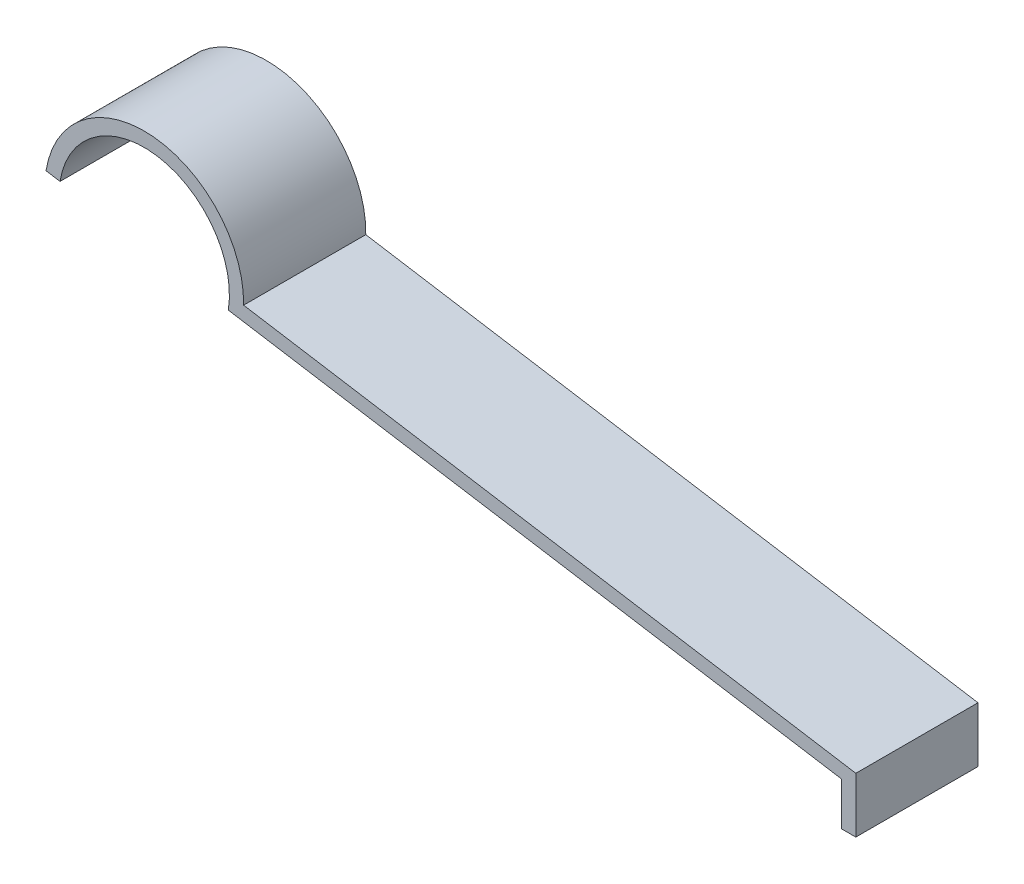
ISO-10303-21;
HEADER;
FILE_DESCRIPTION(('STEP AP214'),'2;1');
FILE_NAME('part.step','',(''),(''),'','','');
FILE_SCHEMA(('AUTOMOTIVE_DESIGN { 1 0 10303 214 1 1 1 1 }'));
ENDSEC;
DATA;
#1=APPLICATION_CONTEXT('core data for automotive mechanical design processes');
#2=APPLICATION_PROTOCOL_DEFINITION('international standard','automotive_design',2000,#1);
#3=PRODUCT_CONTEXT('',#1,'mechanical');
#4=PRODUCT('Part','Part','',(#3));
#5=PRODUCT_RELATED_PRODUCT_CATEGORY('part','',(#4));
#6=PRODUCT_DEFINITION_FORMATION('','',#4);
#7=PRODUCT_DEFINITION_CONTEXT('part definition',#1,'design');
#8=PRODUCT_DEFINITION('design','',#6,#7);
#9=PRODUCT_DEFINITION_SHAPE('','',#8);
#10=(LENGTH_UNIT() NAMED_UNIT(*) SI_UNIT(.MILLI.,.METRE.));
#11=(NAMED_UNIT(*) PLANE_ANGLE_UNIT() SI_UNIT($,.RADIAN.));
#12=(NAMED_UNIT(*) SI_UNIT($,.STERADIAN.) SOLID_ANGLE_UNIT());
#13=UNCERTAINTY_MEASURE_WITH_UNIT(LENGTH_MEASURE(1.E-05),#10,'distance_accuracy_value','');
#14=(GEOMETRIC_REPRESENTATION_CONTEXT(3) GLOBAL_UNCERTAINTY_ASSIGNED_CONTEXT((#13)) GLOBAL_UNIT_ASSIGNED_CONTEXT((#10,
#11,#12)) REPRESENTATION_CONTEXT('',''));
#15=CARTESIAN_POINT('',(0.,0.,0.));
#16=DIRECTION('',(0.,0.,1.));
#17=DIRECTION('',(1.,0.,0.));
#18=AXIS2_PLACEMENT_3D('',#15,#16,#17);
#19=CARTESIAN_POINT('',(0.5,0.,2.15));
#20=DIRECTION('',(0.,1.,0.));
#21=DIRECTION('',(-1.,0.,0.));
#22=AXIS2_PLACEMENT_3D('',#19,#20,#21);
#23=PLANE('',#22);
#24=DIRECTION('',(1.,0.,0.));
#25=VECTOR('',#24,1.);
#26=CARTESIAN_POINT('',(0.5,0.,-2.15));
#27=LINE('',#26,#25);
#28=CARTESIAN_POINT('',(0.,0.,-2.15));
#29=VERTEX_POINT('',#28);
#30=CARTESIAN_POINT('',(0.5,0.,-2.15));
#31=VERTEX_POINT('',#30);
#32=EDGE_CURVE('E85',#29,#31,#27,.T.);
#33=ORIENTED_EDGE('',*,*,#32,.T.);
#34=DIRECTION('',(0.,0.,-1.));
#35=VECTOR('',#34,1.);
#36=CARTESIAN_POINT('',(0.5,0.,2.15));
#37=LINE('',#36,#35);
#38=CARTESIAN_POINT('',(0.5,0.,2.15));
#39=VERTEX_POINT('',#38);
#40=EDGE_CURVE('E11',#39,#31,#37,.T.);
#41=ORIENTED_EDGE('',*,*,#40,.F.);
#42=DIRECTION('',(1.,0.,0.));
#43=VECTOR('',#42,1.);
#44=CARTESIAN_POINT('',(0.5,0.,2.15));
#45=LINE('',#44,#43);
#46=CARTESIAN_POINT('',(0.,0.,2.15));
#47=VERTEX_POINT('',#46);
#48=EDGE_CURVE('E112',#47,#39,#45,.T.);
#49=ORIENTED_EDGE('',*,*,#48,.F.);
#50=DIRECTION('',(0.,0.,-1.));
#51=VECTOR('',#50,1.);
#52=CARTESIAN_POINT('',(0.,0.,2.15));
#53=LINE('',#52,#51);
#54=EDGE_CURVE('E98',#47,#29,#53,.T.);
#55=ORIENTED_EDGE('',*,*,#54,.T.);
#56=EDGE_LOOP('',(#33,#41,#49,#55));
#57=FACE_BOUND('',#56,.T.);
#58=ADVANCED_FACE('F17',(#57),#23,.F.);
#59=CARTESIAN_POINT('',(0.5,1.9454581226,2.15));
#60=DIRECTION('',(-1.,0.,0.));
#61=DIRECTION('',(0.,-1.,0.));
#62=AXIS2_PLACEMENT_3D('',#59,#60,#61);
#63=PLANE('',#62);
#64=DIRECTION('',(0.,1.,0.));
#65=VECTOR('',#64,1.);
#66=CARTESIAN_POINT('',(0.5,1.9454581226,-2.15));
#67=LINE('',#66,#65);
#68=CARTESIAN_POINT('',(0.5,1.9454581226,-2.15));
#69=VERTEX_POINT('',#68);
#70=EDGE_CURVE('E81',#31,#69,#67,.T.);
#71=ORIENTED_EDGE('',*,*,#70,.T.);
#72=DIRECTION('',(0.,0.,-1.));
#73=VECTOR('',#72,1.);
#74=CARTESIAN_POINT('',(0.5,1.9454581226,2.15));
#75=LINE('',#74,#73);
#76=CARTESIAN_POINT('',(0.5,1.9454581226,2.15));
#77=VERTEX_POINT('',#76);
#78=EDGE_CURVE('E24',#77,#69,#75,.T.);
#79=ORIENTED_EDGE('',*,*,#78,.F.);
#80=DIRECTION('',(0.,1.,0.));
#81=VECTOR('',#80,1.);
#82=CARTESIAN_POINT('',(0.5,1.9454581226,2.15));
#83=LINE('',#82,#81);
#84=EDGE_CURVE('E94',#39,#77,#83,.T.);
#85=ORIENTED_EDGE('',*,*,#84,.F.);
#86=ORIENTED_EDGE('',*,*,#40,.T.);
#87=EDGE_LOOP('',(#71,#79,#85,#86));
#88=FACE_BOUND('',#87,.T.);
#89=ADVANCED_FACE('F93',(#88),#63,.F.);
#90=CARTESIAN_POINT('',(-21.0456504402222,5.43895121023184,2.15));
#91=DIRECTION('',(-0.160053473035748,-0.987108345506812,0.));
#92=DIRECTION('',(0.987108345506812,-0.160053473035748,0.));
#93=AXIS2_PLACEMENT_3D('',#90,#91,#92);
#94=PLANE('',#93);
#95=DIRECTION('',(-0.987108345506812,0.160053473035748,0.));
#96=VECTOR('',#95,1.);
#97=CARTESIAN_POINT('',(-21.0456504402222,5.43895121023184,-2.15));
#98=LINE('',#97,#96);
#99=CARTESIAN_POINT('',(-21.0456504402222,5.43895121023184,-2.15));
#100=VERTEX_POINT('',#99);
#101=EDGE_CURVE('E87',#69,#100,#98,.T.);
#102=ORIENTED_EDGE('',*,*,#101,.T.);
#103=DIRECTION('',(0.,0.,-1.));
#104=VECTOR('',#103,1.);
#105=CARTESIAN_POINT('',(-21.0456504402222,5.43895121023184,2.15));
#106=LINE('',#105,#104);
#107=CARTESIAN_POINT('',(-21.0456504402222,5.43895121023184,2.15));
#108=VERTEX_POINT('',#107);
#109=EDGE_CURVE('E138',#108,#100,#106,.T.);
#110=ORIENTED_EDGE('',*,*,#109,.F.);
#111=DIRECTION('',(-0.987108345506812,0.160053473035748,0.));
#112=VECTOR('',#111,1.);
#113=CARTESIAN_POINT('',(-21.0456504402222,5.43895121023184,2.15));
#114=LINE('',#113,#112);
#115=EDGE_CURVE('E115',#77,#108,#114,.T.);
#116=ORIENTED_EDGE('',*,*,#115,.F.);
#117=ORIENTED_EDGE('',*,*,#78,.T.);
#118=EDGE_LOOP('',(#102,#110,#116,#117));
#119=FACE_BOUND('',#118,.T.);
#120=ADVANCED_FACE('F142',(#119),#94,.F.);
#121=CARTESIAN_POINT('',(-24.5451207907261,5.49983853192998,2.15));
#122=DIRECTION('',(0.,0.,-1.));
#123=DIRECTION('',(-1.,0.,0.));
#124=AXIS2_PLACEMENT_3D('',#121,#122,#123);
#125=CYLINDRICAL_SURFACE('',#124,3.5);
#126=CARTESIAN_POINT('',(-24.5451207907261,5.49983853192998,-2.15));
#127=DIRECTION('',(0.,0.,1.));
#128=DIRECTION('',(-1.,0.,0.));
#129=AXIS2_PLACEMENT_3D('',#126,#127,#128);
#130=CIRCLE('',#129,3.5);
#131=CARTESIAN_POINT('',(-28.,6.0600256875551,-2.15));
#132=VERTEX_POINT('',#131);
#133=EDGE_CURVE('E102',#100,#132,#130,.T.);
#134=ORIENTED_EDGE('',*,*,#133,.T.);
#135=DIRECTION('',(0.,0.,-1.));
#136=VECTOR('',#135,1.);
#137=CARTESIAN_POINT('',(-28.,6.0600256875551,2.15));
#138=LINE('',#137,#136);
#139=CARTESIAN_POINT('',(-28.,6.0600256875551,2.15));
#140=VERTEX_POINT('',#139);
#141=EDGE_CURVE('E135',#140,#132,#138,.T.);
#142=ORIENTED_EDGE('',*,*,#141,.F.);
#143=CARTESIAN_POINT('',(-24.5451207907261,5.49983853192998,2.15));
#144=DIRECTION('',(0.,0.,1.));
#145=DIRECTION('',(-1.,0.,0.));
#146=AXIS2_PLACEMENT_3D('',#143,#144,#145);
#147=CIRCLE('',#146,3.5);
#148=EDGE_CURVE('E117',#108,#140,#147,.T.);
#149=ORIENTED_EDGE('',*,*,#148,.F.);
#150=ORIENTED_EDGE('',*,*,#109,.T.);
#151=EDGE_LOOP('',(#134,#142,#149,#150));
#152=FACE_BOUND('',#151,.T.);
#153=ADVANCED_FACE('F150',(#152),#125,.T.);
#154=CARTESIAN_POINT('',(-27.5064458272466,5.97999895103722,2.15));
#155=DIRECTION('',(0.16005347303575,0.987108345506811,0.));
#156=DIRECTION('',(-0.987108345506811,0.16005347303575,0.));
#157=AXIS2_PLACEMENT_3D('',#154,#155,#156);
#158=PLANE('',#157);
#159=DIRECTION('',(0.987108345506811,-0.16005347303575,0.));
#160=VECTOR('',#159,1.);
#161=CARTESIAN_POINT('',(-27.5064458272466,5.97999895103722,-2.15));
#162=LINE('',#161,#160);
#163=CARTESIAN_POINT('',(-27.5064458272466,5.97999895103722,-2.15));
#164=VERTEX_POINT('',#163);
#165=EDGE_CURVE('E104',#132,#164,#162,.T.);
#166=ORIENTED_EDGE('',*,*,#165,.T.);
#167=DIRECTION('',(0.,0.,-1.));
#168=VECTOR('',#167,1.);
#169=CARTESIAN_POINT('',(-27.5064458272466,5.97999895103722,2.15));
#170=LINE('',#169,#168);
#171=CARTESIAN_POINT('',(-27.5064458272466,5.97999895103722,2.15));
#172=VERTEX_POINT('',#171);
#173=EDGE_CURVE('E132',#172,#164,#170,.T.);
#174=ORIENTED_EDGE('',*,*,#173,.F.);
#175=DIRECTION('',(0.987108345506811,-0.16005347303575,0.));
#176=VECTOR('',#175,1.);
#177=CARTESIAN_POINT('',(-27.5064458272466,5.97999895103722,2.15));
#178=LINE('',#177,#176);
#179=EDGE_CURVE('E119',#140,#172,#178,.T.);
#180=ORIENTED_EDGE('',*,*,#179,.F.);
#181=ORIENTED_EDGE('',*,*,#141,.T.);
#182=EDGE_LOOP('',(#166,#174,#180,#181));
#183=FACE_BOUND('',#182,.T.);
#184=ADVANCED_FACE('F153',(#183),#158,.F.);
#185=CARTESIAN_POINT('',(-24.5451207907261,5.49983853192998,2.15));
#186=DIRECTION('',(0.,0.,-1.));
#187=DIRECTION('',(-1.,0.,0.));
#188=AXIS2_PLACEMENT_3D('',#185,#186,#187);
#189=CYLINDRICAL_SURFACE('',#188,3.);
#190=CARTESIAN_POINT('',(-24.5451207907261,5.49983853192998,-2.15));
#191=DIRECTION('',(0.,0.,-1.));
#192=DIRECTION('',(-1.,0.,0.));
#193=AXIS2_PLACEMENT_3D('',#190,#191,#192);
#194=CIRCLE('',#193,3.);
#195=CARTESIAN_POINT('',(-21.5837957542057,5.01967811282274,-2.15));
#196=VERTEX_POINT('',#195);
#197=EDGE_CURVE('E106',#164,#196,#194,.T.);
#198=ORIENTED_EDGE('',*,*,#197,.T.);
#199=DIRECTION('',(0.,0.,-1.));
#200=VECTOR('',#199,1.);
#201=CARTESIAN_POINT('',(-21.5837957542057,5.01967811282274,2.15));
#202=LINE('',#201,#200);
#203=CARTESIAN_POINT('',(-21.5837957542057,5.01967811282274,2.15));
#204=VERTEX_POINT('',#203);
#205=EDGE_CURVE('E129',#204,#196,#202,.T.);
#206=ORIENTED_EDGE('',*,*,#205,.F.);
#207=CARTESIAN_POINT('',(-24.5451207907261,5.49983853192998,2.15));
#208=DIRECTION('',(0.,0.,-1.));
#209=DIRECTION('',(-1.,0.,0.));
#210=AXIS2_PLACEMENT_3D('',#207,#208,#209);
#211=CIRCLE('',#210,3.);
#212=EDGE_CURVE('E121',#172,#204,#211,.T.);
#213=ORIENTED_EDGE('',*,*,#212,.F.);
#214=ORIENTED_EDGE('',*,*,#173,.T.);
#215=EDGE_LOOP('',(#198,#206,#213,#214));
#216=FACE_BOUND('',#215,.T.);
#217=ADVANCED_FACE('F158',(#216),#189,.F.);
#218=CARTESIAN_POINT('',(-21.5837957542057,5.01967811282274,2.15));
#219=DIRECTION('',(0.160053473035748,0.987108345506812,0.));
#220=DIRECTION('',(-0.987108345506812,0.160053473035748,0.));
#221=AXIS2_PLACEMENT_3D('',#218,#219,#220);
#222=PLANE('',#221);
#223=DIRECTION('',(0.987108345506812,-0.160053473035748,0.));
#224=VECTOR('',#223,1.);
#225=CARTESIAN_POINT('',(-21.5837957542057,5.01967811282274,-2.15));
#226=LINE('',#225,#224);
#227=CARTESIAN_POINT('',(0.,1.52,-2.15));
#228=VERTEX_POINT('',#227);
#229=EDGE_CURVE('E108',#196,#228,#226,.T.);
#230=ORIENTED_EDGE('',*,*,#229,.T.);
#231=DIRECTION('',(0.,0.,-1.));
#232=VECTOR('',#231,1.);
#233=CARTESIAN_POINT('',(0.,1.52,2.15));
#234=LINE('',#233,#232);
#235=CARTESIAN_POINT('',(0.,1.52,2.15));
#236=VERTEX_POINT('',#235);
#237=EDGE_CURVE('E126',#236,#228,#234,.T.);
#238=ORIENTED_EDGE('',*,*,#237,.F.);
#239=DIRECTION('',(0.987108345506812,-0.160053473035748,0.));
#240=VECTOR('',#239,1.);
#241=CARTESIAN_POINT('',(-21.5837957542057,5.01967811282274,2.15));
#242=LINE('',#241,#240);
#243=EDGE_CURVE('E36',#204,#236,#242,.T.);
#244=ORIENTED_EDGE('',*,*,#243,.F.);
#245=ORIENTED_EDGE('',*,*,#205,.T.);
#246=EDGE_LOOP('',(#230,#238,#244,#245));
#247=FACE_BOUND('',#246,.T.);
#248=ADVANCED_FACE('F161',(#247),#222,.F.);
#249=CARTESIAN_POINT('',(0.,0.,2.15));
#250=DIRECTION('',(1.,0.,0.));
#251=DIRECTION('',(0.,0.,-1.));
#252=AXIS2_PLACEMENT_3D('',#249,#250,#251);
#253=PLANE('',#252);
#254=DIRECTION('',(0.,-1.,0.));
#255=VECTOR('',#254,1.);
#256=CARTESIAN_POINT('',(0.,0.,-2.15));
#257=LINE('',#256,#255);
#258=EDGE_CURVE('E110',#228,#29,#257,.T.);
#259=ORIENTED_EDGE('',*,*,#258,.T.);
#260=ORIENTED_EDGE('',*,*,#54,.F.);
#261=DIRECTION('',(0.,-1.,0.));
#262=VECTOR('',#261,1.);
#263=CARTESIAN_POINT('',(0.,0.,2.15));
#264=LINE('',#263,#262);
#265=EDGE_CURVE('E31',#236,#47,#264,.T.);
#266=ORIENTED_EDGE('',*,*,#265,.F.);
#267=ORIENTED_EDGE('',*,*,#237,.T.);
#268=EDGE_LOOP('',(#259,#260,#266,#267));
#269=FACE_BOUND('',#268,.T.);
#270=ADVANCED_FACE('F163',(#269),#253,.F.);
#271=CARTESIAN_POINT('',(-24.5451207907261,5.49983853192998,2.15));
#272=DIRECTION('',(0.,0.,-1.));
#273=DIRECTION('',(-1.,0.,0.));
#274=AXIS2_PLACEMENT_3D('',#271,#272,#273);
#275=PLANE('',#274);
#276=ORIENTED_EDGE('',*,*,#48,.T.);
#277=ORIENTED_EDGE('',*,*,#84,.T.);
#278=ORIENTED_EDGE('',*,*,#115,.T.);
#279=ORIENTED_EDGE('',*,*,#148,.T.);
#280=ORIENTED_EDGE('',*,*,#179,.T.);
#281=ORIENTED_EDGE('',*,*,#212,.T.);
#282=ORIENTED_EDGE('',*,*,#243,.T.);
#283=ORIENTED_EDGE('',*,*,#265,.T.);
#284=EDGE_LOOP('',(#276,#277,#278,#279,#280,#281,#282,#283));
#285=FACE_BOUND('',#284,.T.);
#286=ADVANCED_FACE('F145',(#285),#275,.F.);
#287=CARTESIAN_POINT('',(-24.5451207907261,5.49983853192998,-2.15));
#288=DIRECTION('',(0.,0.,-1.));
#289=DIRECTION('',(-1.,0.,0.));
#290=AXIS2_PLACEMENT_3D('',#287,#288,#289);
#291=PLANE('',#290);
#292=ORIENTED_EDGE('',*,*,#32,.F.);
#293=ORIENTED_EDGE('',*,*,#258,.F.);
#294=ORIENTED_EDGE('',*,*,#229,.F.);
#295=ORIENTED_EDGE('',*,*,#197,.F.);
#296=ORIENTED_EDGE('',*,*,#165,.F.);
#297=ORIENTED_EDGE('',*,*,#133,.F.);
#298=ORIENTED_EDGE('',*,*,#101,.F.);
#299=ORIENTED_EDGE('',*,*,#70,.F.);
#300=EDGE_LOOP('',(#292,#293,#294,#295,#296,#297,#298,#299));
#301=FACE_BOUND('',#300,.T.);
#302=ADVANCED_FACE('F82',(#301),#291,.T.);
#303=CLOSED_SHELL('',(#58,#89,#120,#153,#184,#217,#248,#270,#286,#302));
#304=MANIFOLD_SOLID_BREP('B1',#303);
#305=ADVANCED_BREP_SHAPE_REPRESENTATION('',(#18,#304),#14);
#306=SHAPE_DEFINITION_REPRESENTATION(#9,#305);
ENDSEC;
END-ISO-10303-21;
